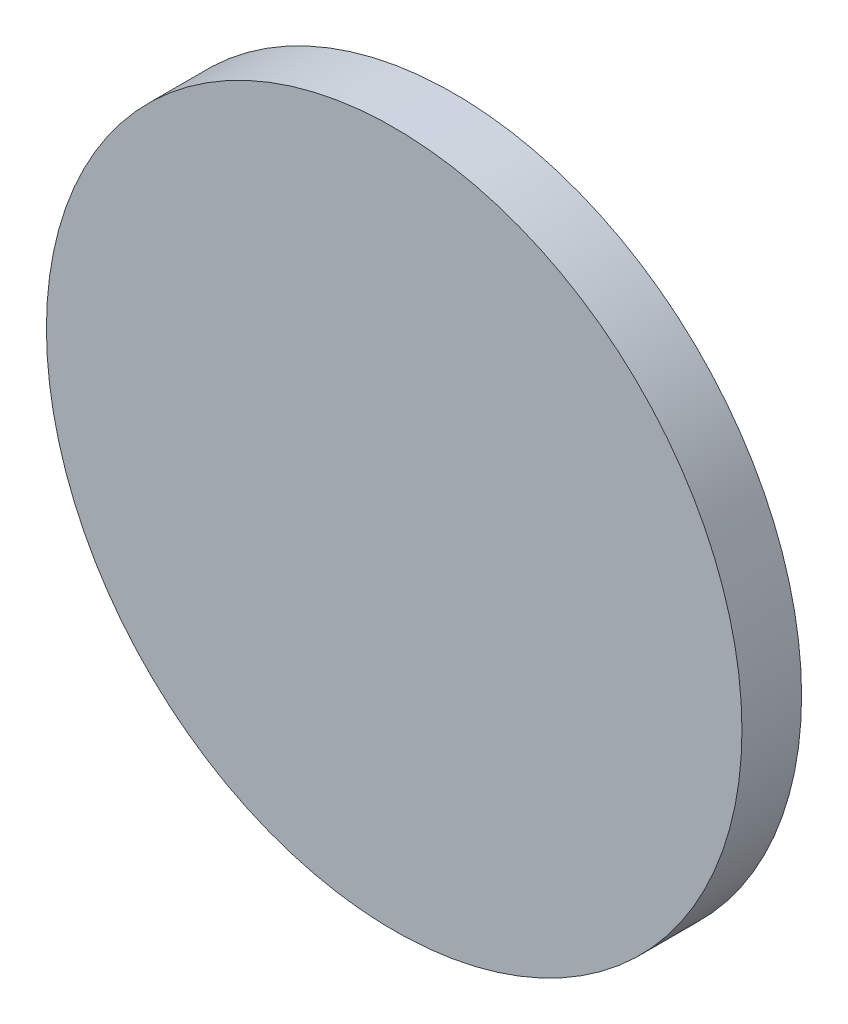
ISO-10303-21;
HEADER;
FILE_DESCRIPTION(('STEP AP214'),'2;1');
FILE_NAME('part.step','',(''),(''),'','','');
FILE_SCHEMA(('AUTOMOTIVE_DESIGN { 1 0 10303 214 1 1 1 1 }'));
ENDSEC;
DATA;
#1=APPLICATION_CONTEXT('core data for automotive mechanical design processes');
#2=APPLICATION_PROTOCOL_DEFINITION('international standard','automotive_design',2000,#1);
#3=PRODUCT_CONTEXT('',#1,'mechanical');
#4=PRODUCT('Part','Part','',(#3));
#5=PRODUCT_RELATED_PRODUCT_CATEGORY('part','',(#4));
#6=PRODUCT_DEFINITION_FORMATION('','',#4);
#7=PRODUCT_DEFINITION_CONTEXT('part definition',#1,'design');
#8=PRODUCT_DEFINITION('design','',#6,#7);
#9=PRODUCT_DEFINITION_SHAPE('','',#8);
#10=(LENGTH_UNIT() NAMED_UNIT(*) SI_UNIT(.MILLI.,.METRE.));
#11=(NAMED_UNIT(*) PLANE_ANGLE_UNIT() SI_UNIT($,.RADIAN.));
#12=(NAMED_UNIT(*) SI_UNIT($,.STERADIAN.) SOLID_ANGLE_UNIT());
#13=UNCERTAINTY_MEASURE_WITH_UNIT(LENGTH_MEASURE(1.E-05),#10,'distance_accuracy_value','');
#14=(GEOMETRIC_REPRESENTATION_CONTEXT(3) GLOBAL_UNCERTAINTY_ASSIGNED_CONTEXT((#13)) GLOBAL_UNIT_ASSIGNED_CONTEXT((#10,
#11,#12)) REPRESENTATION_CONTEXT('',''));
#15=CARTESIAN_POINT('',(0.,0.,0.));
#16=DIRECTION('',(0.,0.,1.));
#17=DIRECTION('',(1.,0.,0.));
#18=AXIS2_PLACEMENT_3D('',#15,#16,#17);
#19=CARTESIAN_POINT('',(4.19608,1.78308,0.76487));
#20=DIRECTION('',(0.,0.,-1.));
#21=DIRECTION('',(-1.,0.,0.));
#22=AXIS2_PLACEMENT_3D('',#19,#20,#21);
#23=PLANE('',#22);
#24=CARTESIAN_POINT('',(4.19608,1.78308,0.76487));
#25=DIRECTION('',(0.,0.,1.));
#26=DIRECTION('',(1.,0.,0.));
#27=AXIS2_PLACEMENT_3D('',#24,#25,#26);
#28=CIRCLE('',#27,0.200024667);
#29=CARTESIAN_POINT('',(4.396104667,1.78308,0.76487));
#30=VERTEX_POINT('',#29);
#31=EDGE_CURVE('E18',#30,#30,#28,.T.);
#32=ORIENTED_EDGE('',*,*,#31,.F.);
#33=EDGE_LOOP('',(#32));
#34=FACE_BOUND('',#33,.T.);
#35=ADVANCED_FACE('F15',(#34),#23,.T.);
#36=CARTESIAN_POINT('',(4.19608,1.78308,0.76487));
#37=DIRECTION('',(0.,0.,1.));
#38=DIRECTION('',(1.,0.,0.));
#39=AXIS2_PLACEMENT_3D('',#36,#37,#38);
#40=CYLINDRICAL_SURFACE('',#39,0.200024667);
#41=CARTESIAN_POINT('',(4.19608,1.78308,0.79916));
#42=DIRECTION('',(0.,0.,1.));
#43=DIRECTION('',(1.,0.,0.));
#44=AXIS2_PLACEMENT_3D('',#41,#42,#43);
#45=CIRCLE('',#44,0.200024667);
#46=CARTESIAN_POINT('',(4.396104667,1.78308,0.79916));
#47=VERTEX_POINT('',#46);
#48=EDGE_CURVE('E10',#47,#47,#45,.T.);
#49=ORIENTED_EDGE('',*,*,#48,.F.);
#50=EDGE_LOOP('',(#49));
#51=FACE_BOUND('',#50,.T.);
#52=ORIENTED_EDGE('',*,*,#31,.T.);
#53=EDGE_LOOP('',(#52));
#54=FACE_BOUND('',#53,.T.);
#55=ADVANCED_FACE('F27',(#51,#54),#40,.T.);
#56=CARTESIAN_POINT('',(4.19608,1.78308,0.79916));
#57=DIRECTION('',(0.,0.,1.));
#58=DIRECTION('',(1.,0.,0.));
#59=AXIS2_PLACEMENT_3D('',#56,#57,#58);
#60=PLANE('',#59);
#61=ORIENTED_EDGE('',*,*,#48,.T.);
#62=EDGE_LOOP('',(#61));
#63=FACE_BOUND('',#62,.T.);
#64=ADVANCED_FACE('F34',(#63),#60,.T.);
#65=CLOSED_SHELL('',(#35,#55,#64));
#66=MANIFOLD_SOLID_BREP('B1',#65);
#67=ADVANCED_BREP_SHAPE_REPRESENTATION('',(#18,#66),#14);
#68=SHAPE_DEFINITION_REPRESENTATION(#9,#67);
ENDSEC;
END-ISO-10303-21;
